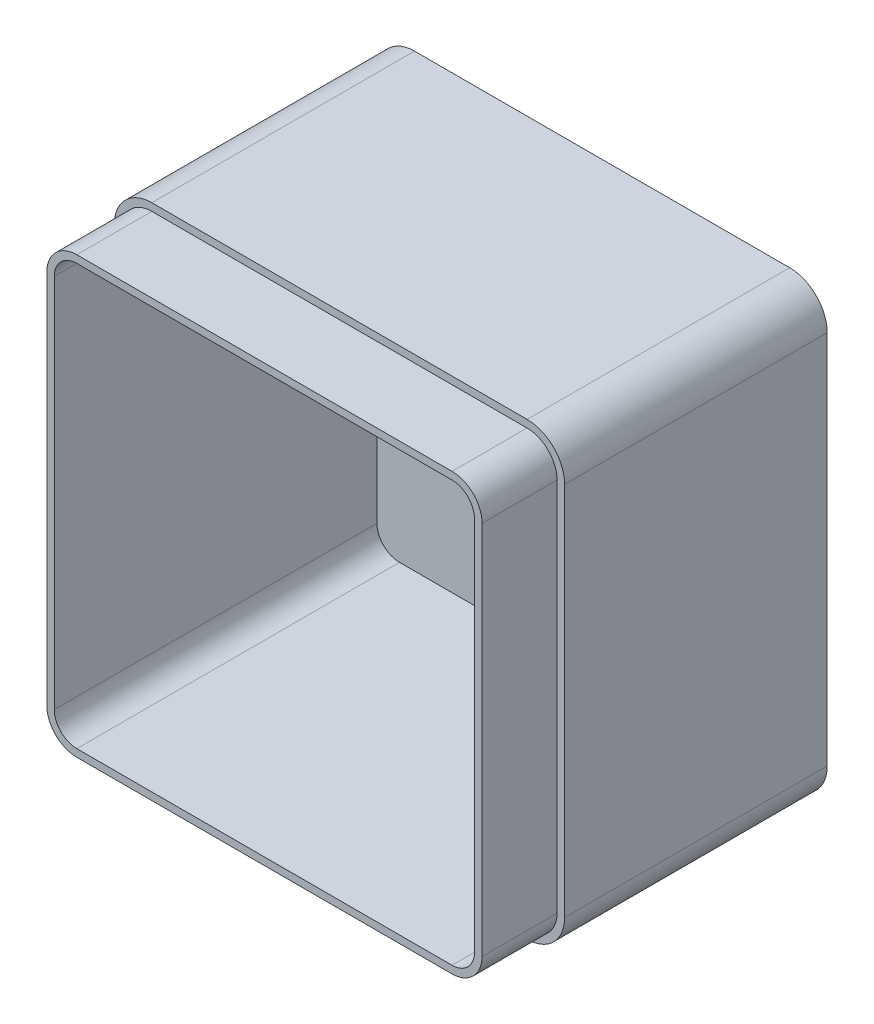
ISO-10303-21;
HEADER;
FILE_DESCRIPTION(('STEP AP214'),'2;1');
FILE_NAME('part.step','',(''),(''),'','','');
FILE_SCHEMA(('AUTOMOTIVE_DESIGN { 1 0 10303 214 1 1 1 1 }'));
ENDSEC;
DATA;
#1=APPLICATION_CONTEXT('core data for automotive mechanical design processes');
#2=APPLICATION_PROTOCOL_DEFINITION('international standard','automotive_design',2000,#1);
#3=PRODUCT_CONTEXT('',#1,'mechanical');
#4=PRODUCT('Part','Part','',(#3));
#5=PRODUCT_RELATED_PRODUCT_CATEGORY('part','',(#4));
#6=PRODUCT_DEFINITION_FORMATION('','',#4);
#7=PRODUCT_DEFINITION_CONTEXT('part definition',#1,'design');
#8=PRODUCT_DEFINITION('design','',#6,#7);
#9=PRODUCT_DEFINITION_SHAPE('','',#8);
#10=(LENGTH_UNIT() NAMED_UNIT(*) SI_UNIT(.MILLI.,.METRE.));
#11=(NAMED_UNIT(*) PLANE_ANGLE_UNIT() SI_UNIT($,.RADIAN.));
#12=(NAMED_UNIT(*) SI_UNIT($,.STERADIAN.) SOLID_ANGLE_UNIT());
#13=UNCERTAINTY_MEASURE_WITH_UNIT(LENGTH_MEASURE(1.E-05),#10,'distance_accuracy_value','');
#14=(GEOMETRIC_REPRESENTATION_CONTEXT(3) GLOBAL_UNCERTAINTY_ASSIGNED_CONTEXT((#13)) GLOBAL_UNIT_ASSIGNED_CONTEXT((#10,
#11,#12)) REPRESENTATION_CONTEXT('',''));
#15=CARTESIAN_POINT('',(0.,0.,0.));
#16=DIRECTION('',(0.,0.,1.));
#17=DIRECTION('',(1.,0.,0.));
#18=AXIS2_PLACEMENT_3D('',#15,#16,#17);
#19=CARTESIAN_POINT('',(0.,0.,90.));
#20=DIRECTION('',(0.,0.,-1.));
#21=DIRECTION('',(-1.,0.,0.));
#22=AXIS2_PLACEMENT_3D('',#19,#20,#21);
#23=PLANE('',#22);
#24=DIRECTION('',(0.,-1.,0.));
#25=VECTOR('',#24,1.);
#26=CARTESIAN_POINT('',(4.,0.,90.));
#27=LINE('',#26,#25);
#28=CARTESIAN_POINT('',(3.99999999999996,110.,90.));
#29=VERTEX_POINT('',#28);
#30=CARTESIAN_POINT('',(4.,9.99999999999999,90.));
#31=VERTEX_POINT('',#30);
#32=EDGE_CURVE('E349',#29,#31,#27,.T.);
#33=ORIENTED_EDGE('',*,*,#32,.F.);
#34=CARTESIAN_POINT('',(9.99999999999996,110.,90.));
#35=DIRECTION('',(0.,0.,-1.));
#36=DIRECTION('',(-1.,0.,0.));
#37=AXIS2_PLACEMENT_3D('',#34,#35,#36);
#38=CIRCLE('',#37,6.);
#39=CARTESIAN_POINT('',(9.99999999999996,116.,90.));
#40=VERTEX_POINT('',#39);
#41=EDGE_CURVE('E395',#40,#29,#38,.F.);
#42=ORIENTED_EDGE('',*,*,#41,.F.);
#43=DIRECTION('',(-1.,0.,0.));
#44=VECTOR('',#43,1.);
#45=CARTESIAN_POINT('',(0.,116.,90.));
#46=LINE('',#45,#44);
#47=CARTESIAN_POINT('',(110.,116.,90.));
#48=VERTEX_POINT('',#47);
#49=EDGE_CURVE('E364',#48,#40,#46,.T.);
#50=ORIENTED_EDGE('',*,*,#49,.F.);
#51=CARTESIAN_POINT('',(110.,110.,90.));
#52=DIRECTION('',(0.,0.,-1.));
#53=DIRECTION('',(-1.,0.,0.));
#54=AXIS2_PLACEMENT_3D('',#51,#52,#53);
#55=CIRCLE('',#54,6.);
#56=CARTESIAN_POINT('',(116.,110.,90.));
#57=VERTEX_POINT('',#56);
#58=EDGE_CURVE('E328',#57,#48,#55,.F.);
#59=ORIENTED_EDGE('',*,*,#58,.F.);
#60=DIRECTION('',(0.,1.,0.));
#61=VECTOR('',#60,1.);
#62=CARTESIAN_POINT('',(116.,0.,90.));
#63=LINE('',#62,#61);
#64=CARTESIAN_POINT('',(116.,9.99999999999999,90.));
#65=VERTEX_POINT('',#64);
#66=EDGE_CURVE('E392',#65,#57,#63,.T.);
#67=ORIENTED_EDGE('',*,*,#66,.F.);
#68=CARTESIAN_POINT('',(110.,9.99999999999999,90.));
#69=DIRECTION('',(0.,0.,-1.));
#70=DIRECTION('',(-1.,0.,0.));
#71=AXIS2_PLACEMENT_3D('',#68,#69,#70);
#72=CIRCLE('',#71,6.);
#73=CARTESIAN_POINT('',(110.,4.,90.));
#74=VERTEX_POINT('',#73);
#75=EDGE_CURVE('E388',#74,#65,#72,.F.);
#76=ORIENTED_EDGE('',*,*,#75,.F.);
#77=DIRECTION('',(1.,0.,0.));
#78=VECTOR('',#77,1.);
#79=CARTESIAN_POINT('',(0.,4.,90.));
#80=LINE('',#79,#78);
#81=CARTESIAN_POINT('',(9.99999999999999,4.,90.));
#82=VERTEX_POINT('',#81);
#83=EDGE_CURVE('E385',#82,#74,#80,.T.);
#84=ORIENTED_EDGE('',*,*,#83,.F.);
#85=CARTESIAN_POINT('',(9.99999999999999,9.99999999999999,90.));
#86=DIRECTION('',(0.,0.,-1.));
#87=DIRECTION('',(-1.,0.,0.));
#88=AXIS2_PLACEMENT_3D('',#85,#86,#87);
#89=CIRCLE('',#88,6.);
#90=EDGE_CURVE('E373',#31,#82,#89,.F.);
#91=ORIENTED_EDGE('',*,*,#90,.F.);
#92=EDGE_LOOP('',(#33,#42,#50,#59,#67,#76,#84,#91));
#93=FACE_BOUND('',#92,.T.);
#94=CARTESIAN_POINT('',(9.99999999999996,110.,90.));
#95=DIRECTION('',(0.,0.,1.));
#96=DIRECTION('',(1.,0.,0.));
#97=AXIS2_PLACEMENT_3D('',#94,#95,#96);
#98=CIRCLE('',#97,8.);
#99=CARTESIAN_POINT('',(9.99999999999995,118.,90.));
#100=VERTEX_POINT('',#99);
#101=CARTESIAN_POINT('',(1.99999999999996,110.,90.));
#102=VERTEX_POINT('',#101);
#103=EDGE_CURVE('E256',#100,#102,#98,.T.);
#104=ORIENTED_EDGE('',*,*,#103,.T.);
#105=DIRECTION('',(0.,-1.,0.));
#106=VECTOR('',#105,1.);
#107=CARTESIAN_POINT('',(1.99999999999996,110.,90.));
#108=LINE('',#107,#106);
#109=CARTESIAN_POINT('',(1.99999999999999,9.99999999999999,90.));
#110=VERTEX_POINT('',#109);
#111=EDGE_CURVE('E206',#102,#110,#108,.T.);
#112=ORIENTED_EDGE('',*,*,#111,.T.);
#113=CARTESIAN_POINT('',(9.99999999999999,9.99999999999999,90.));
#114=DIRECTION('',(0.,0.,1.));
#115=DIRECTION('',(1.,0.,0.));
#116=AXIS2_PLACEMENT_3D('',#113,#114,#115);
#117=CIRCLE('',#116,8.);
#118=CARTESIAN_POINT('',(9.99999999999999,2.,90.));
#119=VERTEX_POINT('',#118);
#120=EDGE_CURVE('E54',#110,#119,#117,.T.);
#121=ORIENTED_EDGE('',*,*,#120,.T.);
#122=DIRECTION('',(1.,0.,0.));
#123=VECTOR('',#122,1.);
#124=CARTESIAN_POINT('',(9.99999999999999,2.,90.));
#125=LINE('',#124,#123);
#126=CARTESIAN_POINT('',(110.,2.,90.));
#127=VERTEX_POINT('',#126);
#128=EDGE_CURVE('E263',#119,#127,#125,.T.);
#129=ORIENTED_EDGE('',*,*,#128,.T.);
#130=CARTESIAN_POINT('',(110.,9.99999999999999,90.));
#131=DIRECTION('',(0.,0.,1.));
#132=DIRECTION('',(1.,0.,0.));
#133=AXIS2_PLACEMENT_3D('',#130,#131,#132);
#134=CIRCLE('',#133,7.99999999999999);
#135=CARTESIAN_POINT('',(118.,9.99999999999999,90.));
#136=VERTEX_POINT('',#135);
#137=EDGE_CURVE('E267',#127,#136,#134,.T.);
#138=ORIENTED_EDGE('',*,*,#137,.T.);
#139=DIRECTION('',(0.,1.,0.));
#140=VECTOR('',#139,1.);
#141=CARTESIAN_POINT('',(118.,9.99999999999999,90.));
#142=LINE('',#141,#140);
#143=CARTESIAN_POINT('',(118.,110.,90.));
#144=VERTEX_POINT('',#143);
#145=EDGE_CURVE('E271',#136,#144,#142,.T.);
#146=ORIENTED_EDGE('',*,*,#145,.T.);
#147=CARTESIAN_POINT('',(110.,110.,90.));
#148=DIRECTION('',(0.,0.,1.));
#149=DIRECTION('',(1.,0.,0.));
#150=AXIS2_PLACEMENT_3D('',#147,#148,#149);
#151=CIRCLE('',#150,7.99999999999999);
#152=CARTESIAN_POINT('',(110.,118.,90.));
#153=VERTEX_POINT('',#152);
#154=EDGE_CURVE('E233',#144,#153,#151,.T.);
#155=ORIENTED_EDGE('',*,*,#154,.T.);
#156=DIRECTION('',(-1.,0.,0.));
#157=VECTOR('',#156,1.);
#158=CARTESIAN_POINT('',(110.,118.,90.));
#159=LINE('',#158,#157);
#160=EDGE_CURVE('E229',#153,#100,#159,.T.);
#161=ORIENTED_EDGE('',*,*,#160,.T.);
#162=EDGE_LOOP('',(#104,#112,#121,#129,#138,#146,#155,#161));
#163=FACE_BOUND('',#162,.T.);
#164=ADVANCED_FACE('F38',(#93,#163),#23,.F.);
#165=CARTESIAN_POINT('',(4.,0.,90.));
#166=DIRECTION('',(1.,0.,0.));
#167=DIRECTION('',(0.,1.,0.));
#168=AXIS2_PLACEMENT_3D('',#165,#166,#167);
#169=PLANE('',#168);
#170=DIRECTION('',(0.,-1.,0.));
#171=VECTOR('',#170,1.);
#172=CARTESIAN_POINT('',(4.,0.,4.));
#173=LINE('',#172,#171);
#174=CARTESIAN_POINT('',(3.99999999999996,110.,4.));
#175=VERTEX_POINT('',#174);
#176=CARTESIAN_POINT('',(4.,9.99999999999999,4.));
#177=VERTEX_POINT('',#176);
#178=EDGE_CURVE('E320',#175,#177,#173,.T.);
#179=ORIENTED_EDGE('',*,*,#178,.F.);
#180=DIRECTION('',(0.,0.,1.));
#181=VECTOR('',#180,1.);
#182=CARTESIAN_POINT('',(3.99999999999996,110.,90.));
#183=LINE('',#182,#181);
#184=EDGE_CURVE('E329',#29,#175,#183,.F.);
#185=ORIENTED_EDGE('',*,*,#184,.F.);
#186=ORIENTED_EDGE('',*,*,#32,.T.);
#187=DIRECTION('',(0.,0.,1.));
#188=VECTOR('',#187,1.);
#189=CARTESIAN_POINT('',(4.,9.99999999999999,90.));
#190=LINE('',#189,#188);
#191=EDGE_CURVE('E325',#177,#31,#190,.T.);
#192=ORIENTED_EDGE('',*,*,#191,.F.);
#193=EDGE_LOOP('',(#179,#185,#186,#192));
#194=FACE_BOUND('',#193,.T.);
#195=ADVANCED_FACE('F503',(#194),#169,.T.);
#196=CARTESIAN_POINT('',(0.,4.,90.));
#197=DIRECTION('',(0.,1.,0.));
#198=DIRECTION('',(0.,0.,1.));
#199=AXIS2_PLACEMENT_3D('',#196,#197,#198);
#200=PLANE('',#199);
#201=ORIENTED_EDGE('',*,*,#83,.T.);
#202=DIRECTION('',(0.,0.,1.));
#203=VECTOR('',#202,1.);
#204=CARTESIAN_POINT('',(110.,4.,90.));
#205=LINE('',#204,#203);
#206=CARTESIAN_POINT('',(110.,4.,4.));
#207=VERTEX_POINT('',#206);
#208=EDGE_CURVE('E361',#207,#74,#205,.T.);
#209=ORIENTED_EDGE('',*,*,#208,.F.);
#210=DIRECTION('',(1.,0.,0.));
#211=VECTOR('',#210,1.);
#212=CARTESIAN_POINT('',(0.,4.,4.));
#213=LINE('',#212,#211);
#214=CARTESIAN_POINT('',(9.99999999999999,4.,4.));
#215=VERTEX_POINT('',#214);
#216=EDGE_CURVE('E324',#215,#207,#213,.T.);
#217=ORIENTED_EDGE('',*,*,#216,.F.);
#218=DIRECTION('',(0.,0.,1.));
#219=VECTOR('',#218,1.);
#220=CARTESIAN_POINT('',(9.99999999999999,4.,90.));
#221=LINE('',#220,#219);
#222=EDGE_CURVE('E352',#82,#215,#221,.F.);
#223=ORIENTED_EDGE('',*,*,#222,.F.);
#224=EDGE_LOOP('',(#201,#209,#217,#223));
#225=FACE_BOUND('',#224,.T.);
#226=ADVANCED_FACE('F509',(#225),#200,.T.);
#227=CARTESIAN_POINT('',(116.,0.,90.));
#228=DIRECTION('',(-1.,0.,0.));
#229=DIRECTION('',(0.,-1.,0.));
#230=AXIS2_PLACEMENT_3D('',#227,#228,#229);
#231=PLANE('',#230);
#232=ORIENTED_EDGE('',*,*,#66,.T.);
#233=DIRECTION('',(0.,0.,1.));
#234=VECTOR('',#233,1.);
#235=CARTESIAN_POINT('',(116.,110.,90.));
#236=LINE('',#235,#234);
#237=CARTESIAN_POINT('',(116.,110.,4.));
#238=VERTEX_POINT('',#237);
#239=EDGE_CURVE('E370',#238,#57,#236,.T.);
#240=ORIENTED_EDGE('',*,*,#239,.F.);
#241=DIRECTION('',(0.,1.,0.));
#242=VECTOR('',#241,1.);
#243=CARTESIAN_POINT('',(116.,0.,4.));
#244=LINE('',#243,#242);
#245=CARTESIAN_POINT('',(116.,9.99999999999999,4.));
#246=VERTEX_POINT('',#245);
#247=EDGE_CURVE('E337',#246,#238,#244,.T.);
#248=ORIENTED_EDGE('',*,*,#247,.F.);
#249=DIRECTION('',(0.,0.,1.));
#250=VECTOR('',#249,1.);
#251=CARTESIAN_POINT('',(116.,9.99999999999999,90.));
#252=LINE('',#251,#250);
#253=EDGE_CURVE('E365',#65,#246,#252,.F.);
#254=ORIENTED_EDGE('',*,*,#253,.F.);
#255=EDGE_LOOP('',(#232,#240,#248,#254));
#256=FACE_BOUND('',#255,.T.);
#257=ADVANCED_FACE('F620',(#256),#231,.T.);
#258=CARTESIAN_POINT('',(0.,116.,90.));
#259=DIRECTION('',(0.,-1.,0.));
#260=DIRECTION('',(0.,0.,-1.));
#261=AXIS2_PLACEMENT_3D('',#258,#259,#260);
#262=PLANE('',#261);
#263=DIRECTION('',(-1.,0.,0.));
#264=VECTOR('',#263,1.);
#265=CARTESIAN_POINT('',(0.,116.,4.));
#266=LINE('',#265,#264);
#267=CARTESIAN_POINT('',(110.,116.,4.));
#268=VERTEX_POINT('',#267);
#269=CARTESIAN_POINT('',(9.99999999999996,116.,4.));
#270=VERTEX_POINT('',#269);
#271=EDGE_CURVE('E345',#268,#270,#266,.T.);
#272=ORIENTED_EDGE('',*,*,#271,.F.);
#273=DIRECTION('',(0.,0.,-1.));
#274=VECTOR('',#273,1.);
#275=CARTESIAN_POINT('',(110.,116.,90.));
#276=LINE('',#275,#274);
#277=EDGE_CURVE('E369',#48,#268,#276,.T.);
#278=ORIENTED_EDGE('',*,*,#277,.F.);
#279=ORIENTED_EDGE('',*,*,#49,.T.);
#280=DIRECTION('',(0.,0.,-1.));
#281=VECTOR('',#280,1.);
#282=CARTESIAN_POINT('',(9.99999999999996,116.,90.));
#283=LINE('',#282,#281);
#284=EDGE_CURVE('E377',#270,#40,#283,.F.);
#285=ORIENTED_EDGE('',*,*,#284,.F.);
#286=EDGE_LOOP('',(#272,#278,#279,#285));
#287=FACE_BOUND('',#286,.T.);
#288=ADVANCED_FACE('F628',(#287),#262,.T.);
#289=CARTESIAN_POINT('',(0.,0.,4.));
#290=DIRECTION('',(0.,0.,-1.));
#291=DIRECTION('',(-1.,0.,0.));
#292=AXIS2_PLACEMENT_3D('',#289,#290,#291);
#293=PLANE('',#292);
#294=ORIENTED_EDGE('',*,*,#216,.T.);
#295=CARTESIAN_POINT('',(110.,9.99999999999999,4.));
#296=DIRECTION('',(0.,0.,-1.));
#297=DIRECTION('',(-1.,0.,0.));
#298=AXIS2_PLACEMENT_3D('',#295,#296,#297);
#299=CIRCLE('',#298,6.);
#300=EDGE_CURVE('E340',#246,#207,#299,.T.);
#301=ORIENTED_EDGE('',*,*,#300,.F.);
#302=ORIENTED_EDGE('',*,*,#247,.T.);
#303=CARTESIAN_POINT('',(110.,110.,4.));
#304=DIRECTION('',(0.,0.,-1.));
#305=DIRECTION('',(-1.,0.,0.));
#306=AXIS2_PLACEMENT_3D('',#303,#304,#305);
#307=CIRCLE('',#306,6.);
#308=EDGE_CURVE('E344',#268,#238,#307,.T.);
#309=ORIENTED_EDGE('',*,*,#308,.F.);
#310=ORIENTED_EDGE('',*,*,#271,.T.);
#311=CARTESIAN_POINT('',(9.99999999999996,110.,4.));
#312=DIRECTION('',(0.,0.,-1.));
#313=DIRECTION('',(-1.,0.,0.));
#314=AXIS2_PLACEMENT_3D('',#311,#312,#313);
#315=CIRCLE('',#314,6.);
#316=EDGE_CURVE('E341',#175,#270,#315,.T.);
#317=ORIENTED_EDGE('',*,*,#316,.F.);
#318=ORIENTED_EDGE('',*,*,#178,.T.);
#319=CARTESIAN_POINT('',(9.99999999999999,9.99999999999999,4.));
#320=DIRECTION('',(0.,0.,-1.));
#321=DIRECTION('',(-1.,0.,0.));
#322=AXIS2_PLACEMENT_3D('',#319,#320,#321);
#323=CIRCLE('',#322,6.);
#324=EDGE_CURVE('E333',#215,#177,#323,.T.);
#325=ORIENTED_EDGE('',*,*,#324,.F.);
#326=EDGE_LOOP('',(#294,#301,#302,#309,#310,#317,#318,#325));
#327=FACE_BOUND('',#326,.T.);
#328=ADVANCED_FACE('F636',(#327),#293,.F.);
#329=CARTESIAN_POINT('',(9.99999999999999,9.99999999999999,90.));
#330=DIRECTION('',(0.,0.,-1.));
#331=DIRECTION('',(-1.,0.,0.));
#332=AXIS2_PLACEMENT_3D('',#329,#330,#331);
#333=CYLINDRICAL_SURFACE('',#332,6.);
#334=ORIENTED_EDGE('',*,*,#90,.T.);
#335=ORIENTED_EDGE('',*,*,#222,.T.);
#336=ORIENTED_EDGE('',*,*,#324,.T.);
#337=ORIENTED_EDGE('',*,*,#191,.T.);
#338=EDGE_LOOP('',(#334,#335,#336,#337));
#339=FACE_BOUND('',#338,.T.);
#340=ADVANCED_FACE('F644',(#339),#333,.F.);
#341=CARTESIAN_POINT('',(110.,9.99999999999999,90.));
#342=DIRECTION('',(0.,0.,-1.));
#343=DIRECTION('',(-1.,0.,0.));
#344=AXIS2_PLACEMENT_3D('',#341,#342,#343);
#345=CYLINDRICAL_SURFACE('',#344,6.);
#346=ORIENTED_EDGE('',*,*,#75,.T.);
#347=ORIENTED_EDGE('',*,*,#253,.T.);
#348=ORIENTED_EDGE('',*,*,#300,.T.);
#349=ORIENTED_EDGE('',*,*,#208,.T.);
#350=EDGE_LOOP('',(#346,#347,#348,#349));
#351=FACE_BOUND('',#350,.T.);
#352=ADVANCED_FACE('F652',(#351),#345,.F.);
#353=CARTESIAN_POINT('',(9.99999999999996,110.,90.));
#354=DIRECTION('',(0.,0.,-1.));
#355=DIRECTION('',(-1.,0.,0.));
#356=AXIS2_PLACEMENT_3D('',#353,#354,#355);
#357=CYLINDRICAL_SURFACE('',#356,6.);
#358=ORIENTED_EDGE('',*,*,#41,.T.);
#359=ORIENTED_EDGE('',*,*,#184,.T.);
#360=ORIENTED_EDGE('',*,*,#316,.T.);
#361=ORIENTED_EDGE('',*,*,#284,.T.);
#362=EDGE_LOOP('',(#358,#359,#360,#361));
#363=FACE_BOUND('',#362,.T.);
#364=ADVANCED_FACE('F660',(#363),#357,.F.);
#365=CARTESIAN_POINT('',(110.,110.,90.));
#366=DIRECTION('',(0.,0.,-1.));
#367=DIRECTION('',(-1.,0.,0.));
#368=AXIS2_PLACEMENT_3D('',#365,#366,#367);
#369=CYLINDRICAL_SURFACE('',#368,6.);
#370=ORIENTED_EDGE('',*,*,#58,.T.);
#371=ORIENTED_EDGE('',*,*,#277,.T.);
#372=ORIENTED_EDGE('',*,*,#308,.T.);
#373=ORIENTED_EDGE('',*,*,#239,.T.);
#374=EDGE_LOOP('',(#370,#371,#372,#373));
#375=FACE_BOUND('',#374,.T.);
#376=ADVANCED_FACE('F516',(#375),#369,.F.);
#377=CARTESIAN_POINT('',(9.99999999999996,110.,70.));
#378=DIRECTION('',(0.,0.,1.));
#379=DIRECTION('',(1.,0.,0.));
#380=AXIS2_PLACEMENT_3D('',#377,#378,#379);
#381=PLANE('',#380);
#382=DIRECTION('',(-1.,0.,0.));
#383=VECTOR('',#382,1.);
#384=CARTESIAN_POINT('',(110.,118.,70.));
#385=LINE('',#384,#383);
#386=CARTESIAN_POINT('',(110.,118.,70.));
#387=VERTEX_POINT('',#386);
#388=CARTESIAN_POINT('',(9.99999999999995,118.,70.));
#389=VERTEX_POINT('',#388);
#390=EDGE_CURVE('E213',#387,#389,#385,.T.);
#391=ORIENTED_EDGE('',*,*,#390,.F.);
#392=CARTESIAN_POINT('',(110.,110.,70.));
#393=DIRECTION('',(0.,0.,1.));
#394=DIRECTION('',(1.,0.,0.));
#395=AXIS2_PLACEMENT_3D('',#392,#393,#394);
#396=CIRCLE('',#395,7.99999999999999);
#397=CARTESIAN_POINT('',(118.,110.,70.));
#398=VERTEX_POINT('',#397);
#399=EDGE_CURVE('E250',#398,#387,#396,.T.);
#400=ORIENTED_EDGE('',*,*,#399,.F.);
#401=DIRECTION('',(0.,1.,0.));
#402=VECTOR('',#401,1.);
#403=CARTESIAN_POINT('',(118.,9.99999999999999,70.));
#404=LINE('',#403,#402);
#405=CARTESIAN_POINT('',(118.,9.99999999999999,70.));
#406=VERTEX_POINT('',#405);
#407=EDGE_CURVE('E246',#406,#398,#404,.T.);
#408=ORIENTED_EDGE('',*,*,#407,.F.);
#409=CARTESIAN_POINT('',(110.,9.99999999999999,70.));
#410=DIRECTION('',(0.,0.,1.));
#411=DIRECTION('',(1.,0.,0.));
#412=AXIS2_PLACEMENT_3D('',#409,#410,#411);
#413=CIRCLE('',#412,7.99999999999999);
#414=CARTESIAN_POINT('',(110.,2.,70.));
#415=VERTEX_POINT('',#414);
#416=EDGE_CURVE('E242',#415,#406,#413,.T.);
#417=ORIENTED_EDGE('',*,*,#416,.F.);
#418=DIRECTION('',(1.,0.,0.));
#419=VECTOR('',#418,1.);
#420=CARTESIAN_POINT('',(9.99999999999999,2.,70.));
#421=LINE('',#420,#419);
#422=CARTESIAN_POINT('',(9.99999999999999,2.,70.));
#423=VERTEX_POINT('',#422);
#424=EDGE_CURVE('E238',#423,#415,#421,.T.);
#425=ORIENTED_EDGE('',*,*,#424,.F.);
#426=CARTESIAN_POINT('',(9.99999999999999,9.99999999999999,70.));
#427=DIRECTION('',(0.,0.,1.));
#428=DIRECTION('',(1.,0.,0.));
#429=AXIS2_PLACEMENT_3D('',#426,#427,#428);
#430=CIRCLE('',#429,8.);
#431=CARTESIAN_POINT('',(1.99999999999999,9.99999999999999,70.));
#432=VERTEX_POINT('',#431);
#433=EDGE_CURVE('E223',#432,#423,#430,.T.);
#434=ORIENTED_EDGE('',*,*,#433,.F.);
#435=DIRECTION('',(0.,-1.,0.));
#436=VECTOR('',#435,1.);
#437=CARTESIAN_POINT('',(1.99999999999996,110.,70.));
#438=LINE('',#437,#436);
#439=CARTESIAN_POINT('',(1.99999999999996,110.,70.));
#440=VERTEX_POINT('',#439);
#441=EDGE_CURVE('E204',#440,#432,#438,.T.);
#442=ORIENTED_EDGE('',*,*,#441,.F.);
#443=CARTESIAN_POINT('',(9.99999999999996,110.,70.));
#444=DIRECTION('',(0.,0.,1.));
#445=DIRECTION('',(1.,0.,0.));
#446=AXIS2_PLACEMENT_3D('',#443,#444,#445);
#447=CIRCLE('',#446,8.);
#448=EDGE_CURVE('E219',#389,#440,#447,.T.);
#449=ORIENTED_EDGE('',*,*,#448,.F.);
#450=EDGE_LOOP('',(#391,#400,#408,#417,#425,#434,#442,#449));
#451=FACE_BOUND('',#450,.T.);
#452=CARTESIAN_POINT('',(9.99999999999996,110.,70.));
#453=DIRECTION('',(0.,0.,1.));
#454=DIRECTION('',(1.,0.,0.));
#455=AXIS2_PLACEMENT_3D('',#452,#453,#454);
#456=CIRCLE('',#455,10.);
#457=CARTESIAN_POINT('',(9.99999999999996,120.,70.));
#458=VERTEX_POINT('',#457);
#459=CARTESIAN_POINT('',(0.,110.,70.));
#460=VERTEX_POINT('',#459);
#461=EDGE_CURVE('E280',#458,#460,#456,.T.);
#462=ORIENTED_EDGE('',*,*,#461,.T.);
#463=DIRECTION('',(0.,-1.,0.));
#464=VECTOR('',#463,1.);
#465=CARTESIAN_POINT('',(0.,110.,70.));
#466=LINE('',#465,#464);
#467=CARTESIAN_POINT('',(0.,9.99999999999999,70.));
#468=VERTEX_POINT('',#467);
#469=EDGE_CURVE('E300',#460,#468,#466,.T.);
#470=ORIENTED_EDGE('',*,*,#469,.T.);
#471=CARTESIAN_POINT('',(9.99999999999999,9.99999999999999,70.));
#472=DIRECTION('',(0.,0.,1.));
#473=DIRECTION('',(1.,0.,0.));
#474=AXIS2_PLACEMENT_3D('',#471,#472,#473);
#475=CIRCLE('',#474,10.);
#476=CARTESIAN_POINT('',(9.99999999999999,0.,70.));
#477=VERTEX_POINT('',#476);
#478=EDGE_CURVE('E303',#468,#477,#475,.T.);
#479=ORIENTED_EDGE('',*,*,#478,.T.);
#480=DIRECTION('',(1.,0.,0.));
#481=VECTOR('',#480,1.);
#482=CARTESIAN_POINT('',(9.99999999999999,0.,70.));
#483=LINE('',#482,#481);
#484=CARTESIAN_POINT('',(110.,0.,70.));
#485=VERTEX_POINT('',#484);
#486=EDGE_CURVE('E306',#477,#485,#483,.T.);
#487=ORIENTED_EDGE('',*,*,#486,.T.);
#488=CARTESIAN_POINT('',(110.,9.99999999999999,70.));
#489=DIRECTION('',(0.,0.,1.));
#490=DIRECTION('',(1.,0.,0.));
#491=AXIS2_PLACEMENT_3D('',#488,#489,#490);
#492=CIRCLE('',#491,9.99999999999999);
#493=CARTESIAN_POINT('',(120.,9.99999999999999,70.));
#494=VERTEX_POINT('',#493);
#495=EDGE_CURVE('E309',#485,#494,#492,.T.);
#496=ORIENTED_EDGE('',*,*,#495,.T.);
#497=DIRECTION('',(0.,1.,0.));
#498=VECTOR('',#497,1.);
#499=CARTESIAN_POINT('',(120.,9.99999999999999,70.));
#500=LINE('',#499,#498);
#501=CARTESIAN_POINT('',(120.,110.,70.));
#502=VERTEX_POINT('',#501);
#503=EDGE_CURVE('E62',#494,#502,#500,.T.);
#504=ORIENTED_EDGE('',*,*,#503,.T.);
#505=CARTESIAN_POINT('',(110.,110.,70.));
#506=DIRECTION('',(0.,0.,1.));
#507=DIRECTION('',(1.,0.,0.));
#508=AXIS2_PLACEMENT_3D('',#505,#506,#507);
#509=CIRCLE('',#508,9.99999999999999);
#510=CARTESIAN_POINT('',(110.,120.,70.));
#511=VERTEX_POINT('',#510);
#512=EDGE_CURVE('E314',#502,#511,#509,.T.);
#513=ORIENTED_EDGE('',*,*,#512,.T.);
#514=DIRECTION('',(-1.,0.,0.));
#515=VECTOR('',#514,1.);
#516=CARTESIAN_POINT('',(110.,120.,70.));
#517=LINE('',#516,#515);
#518=EDGE_CURVE('E317',#511,#458,#517,.T.);
#519=ORIENTED_EDGE('',*,*,#518,.T.);
#520=EDGE_LOOP('',(#462,#470,#479,#487,#496,#504,#513,#519));
#521=FACE_BOUND('',#520,.T.);
#522=ADVANCED_FACE('F218',(#451,#521),#381,.T.);
#523=CARTESIAN_POINT('',(9.99999999999996,110.,70.));
#524=DIRECTION('',(0.,0.,1.));
#525=DIRECTION('',(1.,0.,0.));
#526=AXIS2_PLACEMENT_3D('',#523,#524,#525);
#527=CYLINDRICAL_SURFACE('',#526,8.);
#528=ORIENTED_EDGE('',*,*,#103,.F.);
#529=DIRECTION('',(0.,0.,1.));
#530=VECTOR('',#529,1.);
#531=CARTESIAN_POINT('',(9.99999999999995,118.,70.));
#532=LINE('',#531,#530);
#533=EDGE_CURVE('E227',#389,#100,#532,.T.);
#534=ORIENTED_EDGE('',*,*,#533,.F.);
#535=ORIENTED_EDGE('',*,*,#448,.T.);
#536=DIRECTION('',(0.,0.,1.));
#537=VECTOR('',#536,1.);
#538=CARTESIAN_POINT('',(1.99999999999996,110.,70.));
#539=LINE('',#538,#537);
#540=EDGE_CURVE('E201',#440,#102,#539,.T.);
#541=ORIENTED_EDGE('',*,*,#540,.T.);
#542=EDGE_LOOP('',(#528,#534,#535,#541));
#543=FACE_BOUND('',#542,.T.);
#544=ADVANCED_FACE('F226',(#543),#527,.T.);
#545=CARTESIAN_POINT('',(110.,118.,70.));
#546=DIRECTION('',(0.,1.,0.));
#547=DIRECTION('',(0.,0.,1.));
#548=AXIS2_PLACEMENT_3D('',#545,#546,#547);
#549=PLANE('',#548);
#550=ORIENTED_EDGE('',*,*,#160,.F.);
#551=DIRECTION('',(0.,0.,1.));
#552=VECTOR('',#551,1.);
#553=CARTESIAN_POINT('',(110.,118.,70.));
#554=LINE('',#553,#552);
#555=EDGE_CURVE('E281',#387,#153,#554,.T.);
#556=ORIENTED_EDGE('',*,*,#555,.F.);
#557=ORIENTED_EDGE('',*,*,#390,.T.);
#558=ORIENTED_EDGE('',*,*,#533,.T.);
#559=EDGE_LOOP('',(#550,#556,#557,#558));
#560=FACE_BOUND('',#559,.T.);
#561=ADVANCED_FACE('F553',(#560),#549,.T.);
#562=CARTESIAN_POINT('',(110.,110.,70.));
#563=DIRECTION('',(0.,0.,1.));
#564=DIRECTION('',(1.,0.,0.));
#565=AXIS2_PLACEMENT_3D('',#562,#563,#564);
#566=CYLINDRICAL_SURFACE('',#565,7.99999999999999);
#567=ORIENTED_EDGE('',*,*,#154,.F.);
#568=DIRECTION('',(0.,0.,1.));
#569=VECTOR('',#568,1.);
#570=CARTESIAN_POINT('',(118.,110.,70.));
#571=LINE('',#570,#569);
#572=EDGE_CURVE('E284',#398,#144,#571,.T.);
#573=ORIENTED_EDGE('',*,*,#572,.F.);
#574=ORIENTED_EDGE('',*,*,#399,.T.);
#575=ORIENTED_EDGE('',*,*,#555,.T.);
#576=EDGE_LOOP('',(#567,#573,#574,#575));
#577=FACE_BOUND('',#576,.T.);
#578=ADVANCED_FACE('F560',(#577),#566,.T.);
#579=CARTESIAN_POINT('',(118.,9.99999999999999,70.));
#580=DIRECTION('',(1.,0.,0.));
#581=DIRECTION('',(0.,1.,0.));
#582=AXIS2_PLACEMENT_3D('',#579,#580,#581);
#583=PLANE('',#582);
#584=ORIENTED_EDGE('',*,*,#145,.F.);
#585=DIRECTION('',(0.,0.,1.));
#586=VECTOR('',#585,1.);
#587=CARTESIAN_POINT('',(118.,9.99999999999999,70.));
#588=LINE('',#587,#586);
#589=EDGE_CURVE('E287',#406,#136,#588,.T.);
#590=ORIENTED_EDGE('',*,*,#589,.F.);
#591=ORIENTED_EDGE('',*,*,#407,.T.);
#592=ORIENTED_EDGE('',*,*,#572,.T.);
#593=EDGE_LOOP('',(#584,#590,#591,#592));
#594=FACE_BOUND('',#593,.T.);
#595=ADVANCED_FACE('F568',(#594),#583,.T.);
#596=CARTESIAN_POINT('',(110.,9.99999999999999,70.));
#597=DIRECTION('',(0.,0.,1.));
#598=DIRECTION('',(1.,0.,0.));
#599=AXIS2_PLACEMENT_3D('',#596,#597,#598);
#600=CYLINDRICAL_SURFACE('',#599,7.99999999999999);
#601=ORIENTED_EDGE('',*,*,#137,.F.);
#602=DIRECTION('',(0.,0.,1.));
#603=VECTOR('',#602,1.);
#604=CARTESIAN_POINT('',(110.,2.,70.));
#605=LINE('',#604,#603);
#606=EDGE_CURVE('E290',#415,#127,#605,.T.);
#607=ORIENTED_EDGE('',*,*,#606,.F.);
#608=ORIENTED_EDGE('',*,*,#416,.T.);
#609=ORIENTED_EDGE('',*,*,#589,.T.);
#610=EDGE_LOOP('',(#601,#607,#608,#609));
#611=FACE_BOUND('',#610,.T.);
#612=ADVANCED_FACE('F576',(#611),#600,.T.);
#613=CARTESIAN_POINT('',(9.99999999999999,2.,70.));
#614=DIRECTION('',(0.,-1.,0.));
#615=DIRECTION('',(0.,0.,-1.));
#616=AXIS2_PLACEMENT_3D('',#613,#614,#615);
#617=PLANE('',#616);
#618=ORIENTED_EDGE('',*,*,#128,.F.);
#619=DIRECTION('',(0.,0.,1.));
#620=VECTOR('',#619,1.);
#621=CARTESIAN_POINT('',(9.99999999999999,2.,70.));
#622=LINE('',#621,#620);
#623=EDGE_CURVE('E293',#423,#119,#622,.T.);
#624=ORIENTED_EDGE('',*,*,#623,.F.);
#625=ORIENTED_EDGE('',*,*,#424,.T.);
#626=ORIENTED_EDGE('',*,*,#606,.T.);
#627=EDGE_LOOP('',(#618,#624,#625,#626));
#628=FACE_BOUND('',#627,.T.);
#629=ADVANCED_FACE('F584',(#628),#617,.T.);
#630=CARTESIAN_POINT('',(9.99999999999999,9.99999999999999,70.));
#631=DIRECTION('',(0.,0.,1.));
#632=DIRECTION('',(1.,0.,0.));
#633=AXIS2_PLACEMENT_3D('',#630,#631,#632);
#634=CYLINDRICAL_SURFACE('',#633,8.);
#635=ORIENTED_EDGE('',*,*,#120,.F.);
#636=DIRECTION('',(0.,0.,1.));
#637=VECTOR('',#636,1.);
#638=CARTESIAN_POINT('',(1.99999999999999,9.99999999999999,70.));
#639=LINE('',#638,#637);
#640=EDGE_CURVE('E212',#432,#110,#639,.T.);
#641=ORIENTED_EDGE('',*,*,#640,.F.);
#642=ORIENTED_EDGE('',*,*,#433,.T.);
#643=ORIENTED_EDGE('',*,*,#623,.T.);
#644=EDGE_LOOP('',(#635,#641,#642,#643));
#645=FACE_BOUND('',#644,.T.);
#646=ADVANCED_FACE('F592',(#645),#634,.T.);
#647=CARTESIAN_POINT('',(1.99999999999996,110.,70.));
#648=DIRECTION('',(-1.,0.,0.));
#649=DIRECTION('',(0.,-1.,0.));
#650=AXIS2_PLACEMENT_3D('',#647,#648,#649);
#651=PLANE('',#650);
#652=ORIENTED_EDGE('',*,*,#111,.F.);
#653=ORIENTED_EDGE('',*,*,#540,.F.);
#654=ORIENTED_EDGE('',*,*,#441,.T.);
#655=ORIENTED_EDGE('',*,*,#640,.T.);
#656=EDGE_LOOP('',(#652,#653,#654,#655));
#657=FACE_BOUND('',#656,.T.);
#658=ADVANCED_FACE('F203',(#657),#651,.T.);
#659=CARTESIAN_POINT('',(0.,0.,0.));
#660=DIRECTION('',(0.,0.,-1.));
#661=DIRECTION('',(-1.,0.,0.));
#662=AXIS2_PLACEMENT_3D('',#659,#660,#661);
#663=PLANE('',#662);
#664=DIRECTION('',(1.,0.,0.));
#665=VECTOR('',#664,1.);
#666=CARTESIAN_POINT('',(0.,0.,0.));
#667=LINE('',#666,#665);
#668=CARTESIAN_POINT('',(9.99999999999999,0.,0.));
#669=VERTEX_POINT('',#668);
#670=CARTESIAN_POINT('',(110.,0.,0.));
#671=VERTEX_POINT('',#670);
#672=EDGE_CURVE('E408',#669,#671,#667,.T.);
#673=ORIENTED_EDGE('',*,*,#672,.F.);
#674=CARTESIAN_POINT('',(9.99999999999999,9.99999999999999,0.));
#675=DIRECTION('',(0.,0.,-1.));
#676=DIRECTION('',(-1.,0.,0.));
#677=AXIS2_PLACEMENT_3D('',#674,#675,#676);
#678=CIRCLE('',#677,10.);
#679=CARTESIAN_POINT('',(0.,9.99999999999999,0.));
#680=VERTEX_POINT('',#679);
#681=EDGE_CURVE('E436',#669,#680,#678,.T.);
#682=ORIENTED_EDGE('',*,*,#681,.T.);
#683=DIRECTION('',(0.,-1.,0.));
#684=VECTOR('',#683,1.);
#685=CARTESIAN_POINT('',(0.,0.,0.));
#686=LINE('',#685,#684);
#687=CARTESIAN_POINT('',(0.,110.,0.));
#688=VERTEX_POINT('',#687);
#689=EDGE_CURVE('E381',#688,#680,#686,.T.);
#690=ORIENTED_EDGE('',*,*,#689,.F.);
#691=CARTESIAN_POINT('',(9.99999999999996,110.,0.));
#692=DIRECTION('',(0.,0.,-1.));
#693=DIRECTION('',(-1.,0.,0.));
#694=AXIS2_PLACEMENT_3D('',#691,#692,#693);
#695=CIRCLE('',#694,10.);
#696=CARTESIAN_POINT('',(9.99999999999996,120.,0.));
#697=VERTEX_POINT('',#696);
#698=EDGE_CURVE('E430',#688,#697,#695,.T.);
#699=ORIENTED_EDGE('',*,*,#698,.T.);
#700=DIRECTION('',(-1.,0.,0.));
#701=VECTOR('',#700,1.);
#702=CARTESIAN_POINT('',(0.,120.,0.));
#703=LINE('',#702,#701);
#704=CARTESIAN_POINT('',(110.,120.,0.));
#705=VERTEX_POINT('',#704);
#706=EDGE_CURVE('E416',#705,#697,#703,.T.);
#707=ORIENTED_EDGE('',*,*,#706,.F.);
#708=CARTESIAN_POINT('',(110.,110.,0.));
#709=DIRECTION('',(0.,0.,-1.));
#710=DIRECTION('',(-1.,0.,0.));
#711=AXIS2_PLACEMENT_3D('',#708,#709,#710);
#712=CIRCLE('',#711,10.);
#713=CARTESIAN_POINT('',(120.,110.,0.));
#714=VERTEX_POINT('',#713);
#715=EDGE_CURVE('E427',#705,#714,#712,.T.);
#716=ORIENTED_EDGE('',*,*,#715,.T.);
#717=DIRECTION('',(0.,1.,0.));
#718=VECTOR('',#717,1.);
#719=CARTESIAN_POINT('',(120.,0.,0.));
#720=LINE('',#719,#718);
#721=CARTESIAN_POINT('',(120.,9.99999999999999,0.));
#722=VERTEX_POINT('',#721);
#723=EDGE_CURVE('E412',#722,#714,#720,.T.);
#724=ORIENTED_EDGE('',*,*,#723,.F.);
#725=CARTESIAN_POINT('',(110.,9.99999999999999,0.));
#726=DIRECTION('',(0.,0.,-1.));
#727=DIRECTION('',(-1.,0.,0.));
#728=AXIS2_PLACEMENT_3D('',#725,#726,#727);
#729=CIRCLE('',#728,10.);
#730=EDGE_CURVE('E433',#722,#671,#729,.T.);
#731=ORIENTED_EDGE('',*,*,#730,.T.);
#732=EDGE_LOOP('',(#673,#682,#690,#699,#707,#716,#724,#731));
#733=FACE_BOUND('',#732,.T.);
#734=ADVANCED_FACE('F465',(#733),#663,.T.);
#735=CARTESIAN_POINT('',(9.99999999999996,110.,90.));
#736=DIRECTION('',(0.,0.,-1.));
#737=DIRECTION('',(-1.,0.,0.));
#738=AXIS2_PLACEMENT_3D('',#735,#736,#737);
#739=CYLINDRICAL_SURFACE('',#738,10.);
#740=DIRECTION('',(0.,0.,-1.));
#741=VECTOR('',#740,1.);
#742=CARTESIAN_POINT('',(0.,110.,90.));
#743=LINE('',#742,#741);
#744=EDGE_CURVE('E439',#460,#688,#743,.T.);
#745=ORIENTED_EDGE('',*,*,#744,.F.);
#746=ORIENTED_EDGE('',*,*,#461,.F.);
#747=DIRECTION('',(0.,0.,-1.));
#748=VECTOR('',#747,1.);
#749=CARTESIAN_POINT('',(9.99999999999996,120.,90.));
#750=LINE('',#749,#748);
#751=EDGE_CURVE('E11',#697,#458,#750,.F.);
#752=ORIENTED_EDGE('',*,*,#751,.F.);
#753=ORIENTED_EDGE('',*,*,#698,.F.);
#754=EDGE_LOOP('',(#745,#746,#752,#753));
#755=FACE_BOUND('',#754,.T.);
#756=ADVANCED_FACE('F470',(#755),#739,.T.);
#757=CARTESIAN_POINT('',(110.,110.,90.));
#758=DIRECTION('',(0.,0.,-1.));
#759=DIRECTION('',(-1.,0.,0.));
#760=AXIS2_PLACEMENT_3D('',#757,#758,#759);
#761=CYLINDRICAL_SURFACE('',#760,10.);
#762=DIRECTION('',(0.,0.,-1.));
#763=VECTOR('',#762,1.);
#764=CARTESIAN_POINT('',(110.,120.,90.));
#765=LINE('',#764,#763);
#766=EDGE_CURVE('E47',#511,#705,#765,.T.);
#767=ORIENTED_EDGE('',*,*,#766,.F.);
#768=ORIENTED_EDGE('',*,*,#512,.F.);
#769=DIRECTION('',(0.,0.,-1.));
#770=VECTOR('',#769,1.);
#771=CARTESIAN_POINT('',(120.,110.,90.));
#772=LINE('',#771,#770);
#773=EDGE_CURVE('E446',#714,#502,#772,.F.);
#774=ORIENTED_EDGE('',*,*,#773,.F.);
#775=ORIENTED_EDGE('',*,*,#715,.F.);
#776=EDGE_LOOP('',(#767,#768,#774,#775));
#777=FACE_BOUND('',#776,.T.);
#778=ADVANCED_FACE('F40',(#777),#761,.T.);
#779=CARTESIAN_POINT('',(0.,120.,90.));
#780=DIRECTION('',(0.,-1.,0.));
#781=DIRECTION('',(0.,0.,-1.));
#782=AXIS2_PLACEMENT_3D('',#779,#780,#781);
#783=PLANE('',#782);
#784=ORIENTED_EDGE('',*,*,#518,.F.);
#785=ORIENTED_EDGE('',*,*,#766,.T.);
#786=ORIENTED_EDGE('',*,*,#706,.T.);
#787=ORIENTED_EDGE('',*,*,#751,.T.);
#788=EDGE_LOOP('',(#784,#785,#786,#787));
#789=FACE_BOUND('',#788,.T.);
#790=ADVANCED_FACE('F457',(#789),#783,.F.);
#791=CARTESIAN_POINT('',(110.,9.99999999999999,90.));
#792=DIRECTION('',(0.,0.,-1.));
#793=DIRECTION('',(-1.,0.,0.));
#794=AXIS2_PLACEMENT_3D('',#791,#792,#793);
#795=CYLINDRICAL_SURFACE('',#794,10.);
#796=DIRECTION('',(0.,0.,-1.));
#797=VECTOR('',#796,1.);
#798=CARTESIAN_POINT('',(120.,9.99999999999999,90.));
#799=LINE('',#798,#797);
#800=EDGE_CURVE('E450',#494,#722,#799,.T.);
#801=ORIENTED_EDGE('',*,*,#800,.F.);
#802=ORIENTED_EDGE('',*,*,#495,.F.);
#803=DIRECTION('',(0.,0.,-1.));
#804=VECTOR('',#803,1.);
#805=CARTESIAN_POINT('',(110.,0.,90.));
#806=LINE('',#805,#804);
#807=EDGE_CURVE('E420',#671,#485,#806,.F.);
#808=ORIENTED_EDGE('',*,*,#807,.F.);
#809=ORIENTED_EDGE('',*,*,#730,.F.);
#810=EDGE_LOOP('',(#801,#802,#808,#809));
#811=FACE_BOUND('',#810,.T.);
#812=ADVANCED_FACE('F489',(#811),#795,.T.);
#813=CARTESIAN_POINT('',(120.,0.,90.));
#814=DIRECTION('',(-1.,0.,0.));
#815=DIRECTION('',(0.,-1.,0.));
#816=AXIS2_PLACEMENT_3D('',#813,#814,#815);
#817=PLANE('',#816);
#818=ORIENTED_EDGE('',*,*,#503,.F.);
#819=ORIENTED_EDGE('',*,*,#800,.T.);
#820=ORIENTED_EDGE('',*,*,#723,.T.);
#821=ORIENTED_EDGE('',*,*,#773,.T.);
#822=EDGE_LOOP('',(#818,#819,#820,#821));
#823=FACE_BOUND('',#822,.T.);
#824=ADVANCED_FACE('F491',(#823),#817,.F.);
#825=CARTESIAN_POINT('',(9.99999999999999,9.99999999999999,90.));
#826=DIRECTION('',(0.,0.,-1.));
#827=DIRECTION('',(-1.,0.,0.));
#828=AXIS2_PLACEMENT_3D('',#825,#826,#827);
#829=CYLINDRICAL_SURFACE('',#828,10.);
#830=DIRECTION('',(0.,0.,-1.));
#831=VECTOR('',#830,1.);
#832=CARTESIAN_POINT('',(9.99999999999999,0.,90.));
#833=LINE('',#832,#831);
#834=EDGE_CURVE('E424',#477,#669,#833,.T.);
#835=ORIENTED_EDGE('',*,*,#834,.F.);
#836=ORIENTED_EDGE('',*,*,#478,.F.);
#837=DIRECTION('',(0.,0.,-1.));
#838=VECTOR('',#837,1.);
#839=CARTESIAN_POINT('',(0.,9.99999999999999,90.));
#840=LINE('',#839,#838);
#841=EDGE_CURVE('E442',#680,#468,#840,.F.);
#842=ORIENTED_EDGE('',*,*,#841,.F.);
#843=ORIENTED_EDGE('',*,*,#681,.F.);
#844=EDGE_LOOP('',(#835,#836,#842,#843));
#845=FACE_BOUND('',#844,.T.);
#846=ADVANCED_FACE('F480',(#845),#829,.T.);
#847=CARTESIAN_POINT('',(0.,0.,90.));
#848=DIRECTION('',(0.,1.,0.));
#849=DIRECTION('',(0.,0.,1.));
#850=AXIS2_PLACEMENT_3D('',#847,#848,#849);
#851=PLANE('',#850);
#852=ORIENTED_EDGE('',*,*,#486,.F.);
#853=ORIENTED_EDGE('',*,*,#834,.T.);
#854=ORIENTED_EDGE('',*,*,#672,.T.);
#855=ORIENTED_EDGE('',*,*,#807,.T.);
#856=EDGE_LOOP('',(#852,#853,#854,#855));
#857=FACE_BOUND('',#856,.T.);
#858=ADVANCED_FACE('F484',(#857),#851,.F.);
#859=CARTESIAN_POINT('',(0.,0.,90.));
#860=DIRECTION('',(1.,0.,0.));
#861=DIRECTION('',(0.,1.,0.));
#862=AXIS2_PLACEMENT_3D('',#859,#860,#861);
#863=PLANE('',#862);
#864=ORIENTED_EDGE('',*,*,#469,.F.);
#865=ORIENTED_EDGE('',*,*,#744,.T.);
#866=ORIENTED_EDGE('',*,*,#689,.T.);
#867=ORIENTED_EDGE('',*,*,#841,.T.);
#868=EDGE_LOOP('',(#864,#865,#866,#867));
#869=FACE_BOUND('',#868,.T.);
#870=ADVANCED_FACE('F475',(#869),#863,.F.);
#871=CLOSED_SHELL('',(#164,#195,#226,#257,#288,#328,#340,#352,#364,#376,#522,#544,#561,#578,
#595,#612,#629,#646,#658,#734,#756,#778,#790,#812,#824,#846,#858,#870));
#872=MANIFOLD_SOLID_BREP('B2',#871);
#873=ADVANCED_BREP_SHAPE_REPRESENTATION('',(#18,#872),#14);
#874=SHAPE_DEFINITION_REPRESENTATION(#9,#873);
ENDSEC;
END-ISO-10303-21;
